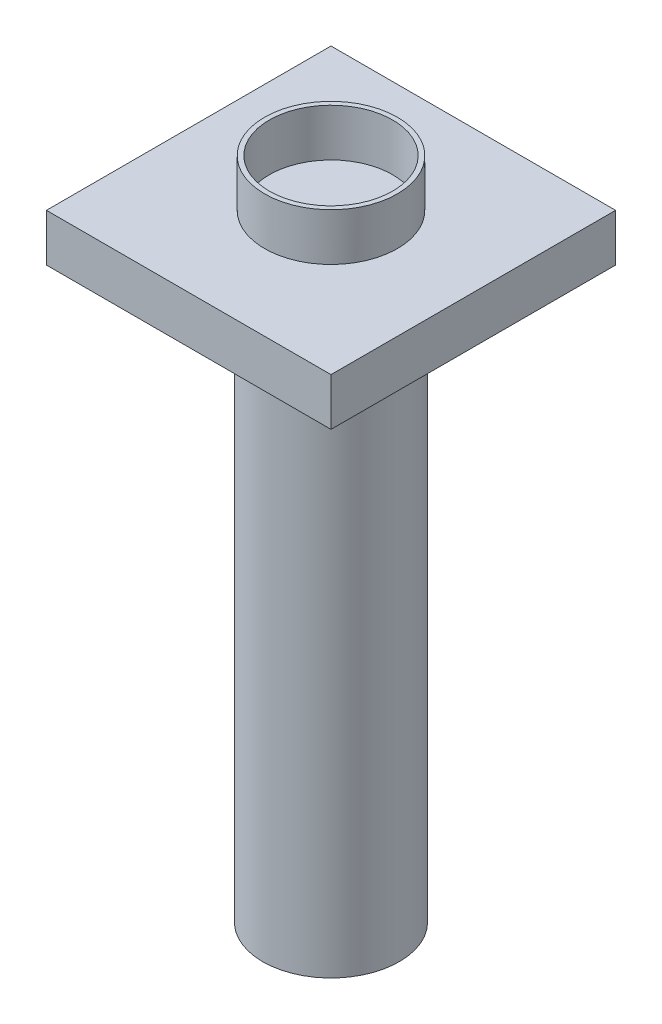
ISO-10303-21;
HEADER;
FILE_DESCRIPTION(('STEP AP214'),'2;1');
FILE_NAME('part.step','',(''),(''),'','','');
FILE_SCHEMA(('AUTOMOTIVE_DESIGN { 1 0 10303 214 1 1 1 1 }'));
ENDSEC;
DATA;
#1=APPLICATION_CONTEXT('core data for automotive mechanical design processes');
#2=APPLICATION_PROTOCOL_DEFINITION('international standard','automotive_design',2000,#1);
#3=PRODUCT_CONTEXT('',#1,'mechanical');
#4=PRODUCT('Part','Part','',(#3));
#5=PRODUCT_RELATED_PRODUCT_CATEGORY('part','',(#4));
#6=PRODUCT_DEFINITION_FORMATION('','',#4);
#7=PRODUCT_DEFINITION_CONTEXT('part definition',#1,'design');
#8=PRODUCT_DEFINITION('design','',#6,#7);
#9=PRODUCT_DEFINITION_SHAPE('','',#8);
#10=(LENGTH_UNIT() NAMED_UNIT(*) SI_UNIT(.MILLI.,.METRE.));
#11=(NAMED_UNIT(*) PLANE_ANGLE_UNIT() SI_UNIT($,.RADIAN.));
#12=(NAMED_UNIT(*) SI_UNIT($,.STERADIAN.) SOLID_ANGLE_UNIT());
#13=UNCERTAINTY_MEASURE_WITH_UNIT(LENGTH_MEASURE(1.E-05),#10,'distance_accuracy_value','');
#14=(GEOMETRIC_REPRESENTATION_CONTEXT(3) GLOBAL_UNCERTAINTY_ASSIGNED_CONTEXT((#13)) GLOBAL_UNIT_ASSIGNED_CONTEXT((#10,
#11,#12)) REPRESENTATION_CONTEXT('',''));
#15=CARTESIAN_POINT('',(0.,0.,0.));
#16=DIRECTION('',(0.,0.,1.));
#17=DIRECTION('',(1.,0.,0.));
#18=AXIS2_PLACEMENT_3D('',#15,#16,#17);
#19=CARTESIAN_POINT('',(0.,600.,0.));
#20=DIRECTION('',(0.,-1.,0.));
#21=DIRECTION('',(0.,0.,-1.));
#22=AXIS2_PLACEMENT_3D('',#19,#20,#21);
#23=CYLINDRICAL_SURFACE('',#22,72.);
#24=CARTESIAN_POINT('',(0.,600.,0.));
#25=DIRECTION('',(0.,1.,0.));
#26=DIRECTION('',(0.,0.,1.));
#27=AXIS2_PLACEMENT_3D('',#24,#25,#26);
#28=CIRCLE('',#27,72.);
#29=CARTESIAN_POINT('',(0.,600.,72.));
#30=VERTEX_POINT('',#29);
#31=EDGE_CURVE('E41',#30,#30,#28,.T.);
#32=ORIENTED_EDGE('',*,*,#31,.F.);
#33=EDGE_LOOP('',(#32));
#34=FACE_BOUND('',#33,.T.);
#35=CARTESIAN_POINT('',(0.,0.,0.));
#36=DIRECTION('',(0.,1.,0.));
#37=DIRECTION('',(0.,0.,1.));
#38=AXIS2_PLACEMENT_3D('',#35,#36,#37);
#39=CIRCLE('',#38,72.);
#40=CARTESIAN_POINT('',(0.,0.,72.));
#41=VERTEX_POINT('',#40);
#42=EDGE_CURVE('E110',#41,#41,#39,.T.);
#43=ORIENTED_EDGE('',*,*,#42,.T.);
#44=EDGE_LOOP('',(#43));
#45=FACE_BOUND('',#44,.T.);
#46=ADVANCED_FACE('F33',(#34,#45),#23,.T.);
#47=CARTESIAN_POINT('',(0.,0.,0.));
#48=DIRECTION('',(0.,1.,0.));
#49=DIRECTION('',(0.,0.,1.));
#50=AXIS2_PLACEMENT_3D('',#47,#48,#49);
#51=PLANE('',#50);
#52=ORIENTED_EDGE('',*,*,#42,.F.);
#53=EDGE_LOOP('',(#52));
#54=FACE_BOUND('',#53,.T.);
#55=ADVANCED_FACE('F116',(#54),#51,.F.);
#56=CARTESIAN_POINT('',(150.,650.,150.));
#57=DIRECTION('',(-1.,0.,0.));
#58=DIRECTION('',(0.,0.,1.));
#59=AXIS2_PLACEMENT_3D('',#56,#57,#58);
#60=PLANE('',#59);
#61=DIRECTION('',(0.,0.,-1.));
#62=VECTOR('',#61,1.);
#63=CARTESIAN_POINT('',(150.,600.,150.));
#64=LINE('',#63,#62);
#65=CARTESIAN_POINT('',(150.,600.,150.));
#66=VERTEX_POINT('',#65);
#67=CARTESIAN_POINT('',(150.,600.,-150.));
#68=VERTEX_POINT('',#67);
#69=EDGE_CURVE('E100',#66,#68,#64,.T.);
#70=ORIENTED_EDGE('',*,*,#69,.T.);
#71=DIRECTION('',(0.,-1.,0.));
#72=VECTOR('',#71,1.);
#73=CARTESIAN_POINT('',(150.,650.,-150.));
#74=LINE('',#73,#72);
#75=CARTESIAN_POINT('',(150.,650.,-150.));
#76=VERTEX_POINT('',#75);
#77=EDGE_CURVE('E91',#76,#68,#74,.T.);
#78=ORIENTED_EDGE('',*,*,#77,.F.);
#79=DIRECTION('',(0.,0.,-1.));
#80=VECTOR('',#79,1.);
#81=CARTESIAN_POINT('',(150.,650.,150.));
#82=LINE('',#81,#80);
#83=CARTESIAN_POINT('',(150.,650.,150.));
#84=VERTEX_POINT('',#83);
#85=EDGE_CURVE('E85',#84,#76,#82,.T.);
#86=ORIENTED_EDGE('',*,*,#85,.F.);
#87=DIRECTION('',(0.,-1.,0.));
#88=VECTOR('',#87,1.);
#89=CARTESIAN_POINT('',(150.,650.,150.));
#90=LINE('',#89,#88);
#91=EDGE_CURVE('E96',#84,#66,#90,.T.);
#92=ORIENTED_EDGE('',*,*,#91,.T.);
#93=EDGE_LOOP('',(#70,#78,#86,#92));
#94=FACE_BOUND('',#93,.T.);
#95=ADVANCED_FACE('F118',(#94),#60,.F.);
#96=CARTESIAN_POINT('',(-150.,650.,-150.));
#97=DIRECTION('',(0.,0.,1.));
#98=DIRECTION('',(1.,0.,0.));
#99=AXIS2_PLACEMENT_3D('',#96,#97,#98);
#100=PLANE('',#99);
#101=DIRECTION('',(-1.,0.,0.));
#102=VECTOR('',#101,1.);
#103=CARTESIAN_POINT('',(-150.,600.,-150.));
#104=LINE('',#103,#102);
#105=CARTESIAN_POINT('',(-150.,600.,-150.));
#106=VERTEX_POINT('',#105);
#107=EDGE_CURVE('E90',#68,#106,#104,.T.);
#108=ORIENTED_EDGE('',*,*,#107,.T.);
#109=DIRECTION('',(0.,-1.,0.));
#110=VECTOR('',#109,1.);
#111=CARTESIAN_POINT('',(-150.,650.,-150.));
#112=LINE('',#111,#110);
#113=CARTESIAN_POINT('',(-150.,650.,-150.));
#114=VERTEX_POINT('',#113);
#115=EDGE_CURVE('E88',#114,#106,#112,.T.);
#116=ORIENTED_EDGE('',*,*,#115,.F.);
#117=DIRECTION('',(-1.,0.,0.));
#118=VECTOR('',#117,1.);
#119=CARTESIAN_POINT('',(-150.,650.,-150.));
#120=LINE('',#119,#118);
#121=EDGE_CURVE('E80',#76,#114,#120,.T.);
#122=ORIENTED_EDGE('',*,*,#121,.F.);
#123=ORIENTED_EDGE('',*,*,#77,.T.);
#124=EDGE_LOOP('',(#108,#116,#122,#123));
#125=FACE_BOUND('',#124,.T.);
#126=ADVANCED_FACE('F89',(#125),#100,.F.);
#127=CARTESIAN_POINT('',(-150.,650.,150.));
#128=DIRECTION('',(1.,0.,0.));
#129=DIRECTION('',(0.,0.,-1.));
#130=AXIS2_PLACEMENT_3D('',#127,#128,#129);
#131=PLANE('',#130);
#132=DIRECTION('',(0.,0.,1.));
#133=VECTOR('',#132,1.);
#134=CARTESIAN_POINT('',(-150.,600.,150.));
#135=LINE('',#134,#133);
#136=CARTESIAN_POINT('',(-150.,600.,150.));
#137=VERTEX_POINT('',#136);
#138=EDGE_CURVE('E66',#106,#137,#135,.T.);
#139=ORIENTED_EDGE('',*,*,#138,.T.);
#140=DIRECTION('',(0.,-1.,0.));
#141=VECTOR('',#140,1.);
#142=CARTESIAN_POINT('',(-150.,650.,150.));
#143=LINE('',#142,#141);
#144=CARTESIAN_POINT('',(-150.,650.,150.));
#145=VERTEX_POINT('',#144);
#146=EDGE_CURVE('E92',#145,#137,#143,.T.);
#147=ORIENTED_EDGE('',*,*,#146,.F.);
#148=DIRECTION('',(0.,0.,1.));
#149=VECTOR('',#148,1.);
#150=CARTESIAN_POINT('',(-150.,650.,150.));
#151=LINE('',#150,#149);
#152=EDGE_CURVE('E83',#114,#145,#151,.T.);
#153=ORIENTED_EDGE('',*,*,#152,.F.);
#154=ORIENTED_EDGE('',*,*,#115,.T.);
#155=EDGE_LOOP('',(#139,#147,#153,#154));
#156=FACE_BOUND('',#155,.T.);
#157=ADVANCED_FACE('F94',(#156),#131,.F.);
#158=CARTESIAN_POINT('',(-150.,650.,150.));
#159=DIRECTION('',(0.,0.,-1.));
#160=DIRECTION('',(-1.,0.,0.));
#161=AXIS2_PLACEMENT_3D('',#158,#159,#160);
#162=PLANE('',#161);
#163=DIRECTION('',(1.,0.,0.));
#164=VECTOR('',#163,1.);
#165=CARTESIAN_POINT('',(-150.,600.,150.));
#166=LINE('',#165,#164);
#167=EDGE_CURVE('E72',#137,#66,#166,.T.);
#168=ORIENTED_EDGE('',*,*,#167,.T.);
#169=ORIENTED_EDGE('',*,*,#91,.F.);
#170=DIRECTION('',(1.,0.,0.));
#171=VECTOR('',#170,1.);
#172=CARTESIAN_POINT('',(-150.,650.,150.));
#173=LINE('',#172,#171);
#174=EDGE_CURVE('E49',#145,#84,#173,.T.);
#175=ORIENTED_EDGE('',*,*,#174,.F.);
#176=ORIENTED_EDGE('',*,*,#146,.T.);
#177=EDGE_LOOP('',(#168,#169,#175,#176));
#178=FACE_BOUND('',#177,.T.);
#179=ADVANCED_FACE('F131',(#178),#162,.F.);
#180=CARTESIAN_POINT('',(0.,650.,0.));
#181=DIRECTION('',(0.,-1.,0.));
#182=DIRECTION('',(0.,0.,-1.));
#183=AXIS2_PLACEMENT_3D('',#180,#181,#182);
#184=PLANE('',#183);
#185=CARTESIAN_POINT('',(0.,650.,0.));
#186=DIRECTION('',(0.,-1.,0.));
#187=DIRECTION('',(0.,0.,-1.));
#188=AXIS2_PLACEMENT_3D('',#185,#186,#187);
#189=CIRCLE('',#188,70.);
#190=CARTESIAN_POINT('',(0.,650.,-70.));
#191=VERTEX_POINT('',#190);
#192=EDGE_CURVE('E11',#191,#191,#189,.F.);
#193=ORIENTED_EDGE('',*,*,#192,.F.);
#194=EDGE_LOOP('',(#193));
#195=FACE_BOUND('',#194,.T.);
#196=ORIENTED_EDGE('',*,*,#85,.T.);
#197=ORIENTED_EDGE('',*,*,#121,.T.);
#198=ORIENTED_EDGE('',*,*,#152,.T.);
#199=ORIENTED_EDGE('',*,*,#174,.T.);
#200=EDGE_LOOP('',(#196,#197,#198,#199));
#201=FACE_BOUND('',#200,.T.);
#202=ADVANCED_FACE('F81',(#195,#201),#184,.F.);
#203=CARTESIAN_POINT('',(0.,600.,0.));
#204=DIRECTION('',(0.,-1.,0.));
#205=DIRECTION('',(0.,0.,-1.));
#206=AXIS2_PLACEMENT_3D('',#203,#204,#205);
#207=PLANE('',#206);
#208=ORIENTED_EDGE('',*,*,#31,.T.);
#209=EDGE_LOOP('',(#208));
#210=FACE_BOUND('',#209,.T.);
#211=ORIENTED_EDGE('',*,*,#69,.F.);
#212=ORIENTED_EDGE('',*,*,#167,.F.);
#213=ORIENTED_EDGE('',*,*,#138,.F.);
#214=ORIENTED_EDGE('',*,*,#107,.F.);
#215=EDGE_LOOP('',(#211,#212,#213,#214));
#216=FACE_BOUND('',#215,.T.);
#217=ADVANCED_FACE('F134',(#210,#216),#207,.T.);
#218=CARTESIAN_POINT('',(0.,700.,0.));
#219=DIRECTION('',(0.,1.,0.));
#220=DIRECTION('',(0.,0.,1.));
#221=AXIS2_PLACEMENT_3D('',#218,#219,#220);
#222=PLANE('',#221);
#223=CARTESIAN_POINT('',(0.,700.,0.));
#224=DIRECTION('',(0.,1.,0.));
#225=DIRECTION('',(0.,0.,1.));
#226=AXIS2_PLACEMENT_3D('',#223,#224,#225);
#227=CIRCLE('',#226,70.);
#228=CARTESIAN_POINT('',(0.,700.,70.));
#229=VERTEX_POINT('',#228);
#230=EDGE_CURVE('E103',#229,#229,#227,.T.);
#231=ORIENTED_EDGE('',*,*,#230,.T.);
#232=EDGE_LOOP('',(#231));
#233=FACE_BOUND('',#232,.T.);
#234=CARTESIAN_POINT('',(0.,700.,0.));
#235=DIRECTION('',(0.,1.,0.));
#236=DIRECTION('',(0.,0.,1.));
#237=AXIS2_PLACEMENT_3D('',#234,#235,#236);
#238=CIRCLE('',#237,65.);
#239=CARTESIAN_POINT('',(0.,700.,65.));
#240=VERTEX_POINT('',#239);
#241=EDGE_CURVE('E160',#240,#240,#238,.T.);
#242=ORIENTED_EDGE('',*,*,#241,.F.);
#243=EDGE_LOOP('',(#242));
#244=FACE_BOUND('',#243,.T.);
#245=ADVANCED_FACE('F137',(#233,#244),#222,.T.);
#246=CARTESIAN_POINT('',(0.,700.,0.));
#247=DIRECTION('',(0.,-1.,0.));
#248=DIRECTION('',(0.,0.,-1.));
#249=AXIS2_PLACEMENT_3D('',#246,#247,#248);
#250=CYLINDRICAL_SURFACE('',#249,70.);
#251=ORIENTED_EDGE('',*,*,#230,.F.);
#252=EDGE_LOOP('',(#251));
#253=FACE_BOUND('',#252,.T.);
#254=ORIENTED_EDGE('',*,*,#192,.T.);
#255=EDGE_LOOP('',(#254));
#256=FACE_BOUND('',#255,.T.);
#257=ADVANCED_FACE('F143',(#253,#256),#250,.T.);
#258=CARTESIAN_POINT('',(0.,700.,0.));
#259=DIRECTION('',(0.,-1.,0.));
#260=DIRECTION('',(0.,0.,-1.));
#261=AXIS2_PLACEMENT_3D('',#258,#259,#260);
#262=CYLINDRICAL_SURFACE('',#261,65.);
#263=ORIENTED_EDGE('',*,*,#241,.T.);
#264=EDGE_LOOP('',(#263));
#265=FACE_BOUND('',#264,.T.);
#266=CARTESIAN_POINT('',(0.,650.,0.));
#267=DIRECTION('',(0.,1.,0.));
#268=DIRECTION('',(0.,0.,1.));
#269=AXIS2_PLACEMENT_3D('',#266,#267,#268);
#270=CIRCLE('',#269,65.);
#271=CARTESIAN_POINT('',(0.,650.,65.));
#272=VERTEX_POINT('',#271);
#273=EDGE_CURVE('E163',#272,#272,#270,.T.);
#274=ORIENTED_EDGE('',*,*,#273,.F.);
#275=EDGE_LOOP('',(#274));
#276=FACE_BOUND('',#275,.T.);
#277=ADVANCED_FACE('F146',(#265,#276),#262,.F.);
#278=ORIENTED_EDGE('',*,*,#273,.T.);
#279=EDGE_LOOP('',(#278));
#280=FACE_BOUND('',#279,.T.);
#281=ADVANCED_FACE('F142',(#280),#184,.F.);
#282=CLOSED_SHELL('',(#46,#55,#95,#126,#157,#179,#202,#217,#245,#257,#277,#281));
#283=MANIFOLD_SOLID_BREP('B2',#282);
#284=ADVANCED_BREP_SHAPE_REPRESENTATION('',(#18,#283),#14);
#285=SHAPE_DEFINITION_REPRESENTATION(#9,#284);
ENDSEC;
END-ISO-10303-21;
